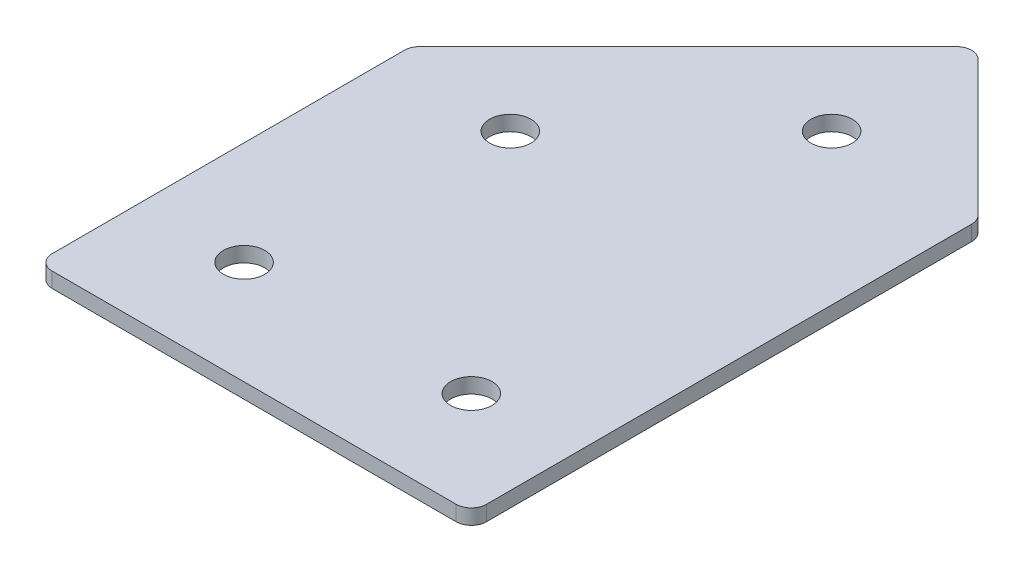
ISO-10303-21;
HEADER;
FILE_DESCRIPTION(('STEP AP214'),'2;1');
FILE_NAME('part.step','',(''),(''),'','','');
FILE_SCHEMA(('AUTOMOTIVE_DESIGN { 1 0 10303 214 1 1 1 1 }'));
ENDSEC;
DATA;
#1=APPLICATION_CONTEXT('core data for automotive mechanical design processes');
#2=APPLICATION_PROTOCOL_DEFINITION('international standard','automotive_design',2000,#1);
#3=PRODUCT_CONTEXT('',#1,'mechanical');
#4=PRODUCT('Part','Part','',(#3));
#5=PRODUCT_RELATED_PRODUCT_CATEGORY('part','',(#4));
#6=PRODUCT_DEFINITION_FORMATION('','',#4);
#7=PRODUCT_DEFINITION_CONTEXT('part definition',#1,'design');
#8=PRODUCT_DEFINITION('design','',#6,#7);
#9=PRODUCT_DEFINITION_SHAPE('','',#8);
#10=(LENGTH_UNIT() NAMED_UNIT(*) SI_UNIT(.MILLI.,.METRE.));
#11=(NAMED_UNIT(*) PLANE_ANGLE_UNIT() SI_UNIT($,.RADIAN.));
#12=(NAMED_UNIT(*) SI_UNIT($,.STERADIAN.) SOLID_ANGLE_UNIT());
#13=UNCERTAINTY_MEASURE_WITH_UNIT(LENGTH_MEASURE(1.E-05),#10,'distance_accuracy_value','');
#14=(GEOMETRIC_REPRESENTATION_CONTEXT(3) GLOBAL_UNCERTAINTY_ASSIGNED_CONTEXT((#13)) GLOBAL_UNIT_ASSIGNED_CONTEXT((#10,
#11,#12)) REPRESENTATION_CONTEXT('',''));
#15=CARTESIAN_POINT('',(0.,0.,0.));
#16=DIRECTION('',(0.,0.,1.));
#17=DIRECTION('',(1.,0.,0.));
#18=AXIS2_PLACEMENT_3D('',#15,#16,#17);
#19=CARTESIAN_POINT('',(-69.8702315611487,2.29118221127328,42.5441315674249));
#20=DIRECTION('',(0.,1.,0.));
#21=DIRECTION('',(0.,0.,1.));
#22=AXIS2_PLACEMENT_3D('',#19,#20,#21);
#23=PLANE('',#22);
#24=CARTESIAN_POINT('',(20.1297684388556,2.29118221127328,42.5441315674249));
#25=DIRECTION('',(0.,1.,0.));
#26=DIRECTION('',(0.,0.,1.));
#27=AXIS2_PLACEMENT_3D('',#24,#25,#26);
#28=CIRCLE('',#27,4.09999999999999);
#29=CARTESIAN_POINT('',(20.1297684388556,2.29118221127328,46.6441315674249));
#30=VERTEX_POINT('',#29);
#31=EDGE_CURVE('E201',#30,#30,#28,.T.);
#32=ORIENTED_EDGE('',*,*,#31,.T.);
#33=EDGE_LOOP('',(#32));
#34=FACE_BOUND('',#33,.T.);
#35=CARTESIAN_POINT('',(10.8099632854608,2.29118221127328,-38.1360632791804));
#36=DIRECTION('',(0.,1.,0.));
#37=DIRECTION('',(0.,0.,1.));
#38=AXIS2_PLACEMENT_3D('',#35,#36,#37);
#39=CIRCLE('',#38,4.09999999999998);
#40=CARTESIAN_POINT('',(10.8099632854608,2.29118221127328,-34.0360632791805));
#41=VERTEX_POINT('',#40);
#42=EDGE_CURVE('E195',#41,#41,#39,.T.);
#43=ORIENTED_EDGE('',*,*,#42,.T.);
#44=EDGE_LOOP('',(#43));
#45=FACE_BOUND('',#44,.T.);
#46=CARTESIAN_POINT('',(-21.0098418679339,2.29118221127328,-6.31625812578581));
#47=DIRECTION('',(0.,1.,0.));
#48=DIRECTION('',(0.,0.,1.));
#49=AXIS2_PLACEMENT_3D('',#46,#47,#48);
#50=CIRCLE('',#49,4.1);
#51=CARTESIAN_POINT('',(-21.0098418679339,2.29118221127328,-2.21625812578581));
#52=VERTEX_POINT('',#51);
#53=EDGE_CURVE('E189',#52,#52,#50,.T.);
#54=ORIENTED_EDGE('',*,*,#53,.T.);
#55=EDGE_LOOP('',(#54));
#56=FACE_BOUND('',#55,.T.);
#57=CARTESIAN_POINT('',(-24.8702315611445,2.29118221127328,42.5441315674249));
#58=DIRECTION('',(0.,1.,0.));
#59=DIRECTION('',(0.,0.,1.));
#60=AXIS2_PLACEMENT_3D('',#57,#58,#59);
#61=CIRCLE('',#60,4.1);
#62=CARTESIAN_POINT('',(-24.8702315611445,2.29118221127328,46.6441315674249));
#63=VERTEX_POINT('',#62);
#64=EDGE_CURVE('E115',#63,#63,#61,.T.);
#65=ORIENTED_EDGE('',*,*,#64,.T.);
#66=EDGE_LOOP('',(#65));
#67=FACE_BOUND('',#66,.T.);
#68=DIRECTION('',(0.,0.,1.));
#69=VECTOR('',#68,1.);
#70=CARTESIAN_POINT('',(-45.3702315611445,2.29118221127328,-10.9472464612239));
#71=LINE('',#70,#69);
#72=CARTESIAN_POINT('',(-45.3702315611445,2.29118221127328,-9.70460577410461));
#73=VERTEX_POINT('',#72);
#74=CARTESIAN_POINT('',(-45.3702315611445,2.29118221127328,60.044131567425));
#75=VERTEX_POINT('',#74);
#76=EDGE_CURVE('E182',#73,#75,#71,.T.);
#77=ORIENTED_EDGE('',*,*,#76,.F.);
#78=CARTESIAN_POINT('',(-42.3702315611445,2.29118221127328,-9.70460577410461));
#79=DIRECTION('',(0.,1.,0.));
#80=DIRECTION('',(0.,0.,1.));
#81=AXIS2_PLACEMENT_3D('',#78,#79,#80);
#82=CIRCLE('',#81,3.);
#83=CARTESIAN_POINT('',(-44.4915519047041,2.29118221127328,-11.8259261176642));
#84=VERTEX_POINT('',#83);
#85=EDGE_CURVE('E146',#73,#84,#82,.F.);
#86=ORIENTED_EDGE('',*,*,#85,.T.);
#87=DIRECTION('',(-0.707106781186547,0.,0.707106781186548));
#88=VECTOR('',#87,1.);
#89=CARTESIAN_POINT('',(10.8099632854607,2.29118221127328,-67.1274413078291));
#90=LINE('',#89,#88);
#91=CARTESIAN_POINT('',(8.68864294190101,2.29118221127328,-65.0061209642694));
#92=VERTEX_POINT('',#91);
#93=EDGE_CURVE('E174',#92,#84,#90,.T.);
#94=ORIENTED_EDGE('',*,*,#93,.F.);
#95=CARTESIAN_POINT('',(10.8099632854607,2.29118221127328,-62.8848006207098));
#96=DIRECTION('',(0.,1.,0.));
#97=DIRECTION('',(0.,0.,1.));
#98=AXIS2_PLACEMENT_3D('',#95,#96,#97);
#99=CIRCLE('',#98,3.);
#100=CARTESIAN_POINT('',(12.9312836290203,2.29118221127328,-65.0061209642694));
#101=VERTEX_POINT('',#100);
#102=EDGE_CURVE('E118',#92,#101,#99,.F.);
#103=ORIENTED_EDGE('',*,*,#102,.T.);
#104=DIRECTION('',(-0.707106781186547,0.,-0.707106781186548));
#105=VECTOR('',#104,1.);
#106=CARTESIAN_POINT('',(40.6297684388556,2.29118221127328,-37.3076361544342));
#107=LINE('',#106,#105);
#108=CARTESIAN_POINT('',(39.7510887824152,2.29118221127328,-38.1863158108745));
#109=VERTEX_POINT('',#108);
#110=EDGE_CURVE('E119',#109,#101,#107,.T.);
#111=ORIENTED_EDGE('',*,*,#110,.F.);
#112=CARTESIAN_POINT('',(37.6297684388556,2.29118221127328,-36.0649954673149));
#113=DIRECTION('',(0.,1.,0.));
#114=DIRECTION('',(0.,0.,1.));
#115=AXIS2_PLACEMENT_3D('',#112,#113,#114);
#116=CIRCLE('',#115,3.);
#117=CARTESIAN_POINT('',(40.6297684388556,2.29118221127328,-36.0649954673149));
#118=VERTEX_POINT('',#117);
#119=EDGE_CURVE('E141',#109,#118,#116,.F.);
#120=ORIENTED_EDGE('',*,*,#119,.T.);
#121=DIRECTION('',(0.,0.,-1.));
#122=VECTOR('',#121,1.);
#123=CARTESIAN_POINT('',(40.6297684388555,2.29118221127328,63.0441315674251));
#124=LINE('',#123,#122);
#125=CARTESIAN_POINT('',(40.6297684388555,2.29118221127328,60.0441315674251));
#126=VERTEX_POINT('',#125);
#127=EDGE_CURVE('E123',#126,#118,#124,.T.);
#128=ORIENTED_EDGE('',*,*,#127,.F.);
#129=CARTESIAN_POINT('',(37.6297684388555,2.29118221127328,60.0441315674251));
#130=DIRECTION('',(0.,1.,0.));
#131=DIRECTION('',(0.,0.,1.));
#132=AXIS2_PLACEMENT_3D('',#129,#130,#131);
#133=CIRCLE('',#132,3.);
#134=CARTESIAN_POINT('',(37.6297684388555,2.29118221127328,63.0441315674251));
#135=VERTEX_POINT('',#134);
#136=EDGE_CURVE('E31',#126,#135,#133,.F.);
#137=ORIENTED_EDGE('',*,*,#136,.T.);
#138=DIRECTION('',(1.,0.,0.));
#139=VECTOR('',#138,1.);
#140=CARTESIAN_POINT('',(-45.3702315611445,2.29118221127328,63.0441315674251));
#141=LINE('',#140,#139);
#142=CARTESIAN_POINT('',(-42.3702315611444,2.29118221127328,63.0441315674251));
#143=VERTEX_POINT('',#142);
#144=EDGE_CURVE('E180',#143,#135,#141,.T.);
#145=ORIENTED_EDGE('',*,*,#144,.F.);
#146=CARTESIAN_POINT('',(-42.3702315611444,2.29118221127328,60.0441315674251));
#147=DIRECTION('',(0.,1.,0.));
#148=DIRECTION('',(0.,0.,1.));
#149=AXIS2_PLACEMENT_3D('',#146,#147,#148);
#150=CIRCLE('',#149,3.);
#151=EDGE_CURVE('E144',#143,#75,#150,.F.);
#152=ORIENTED_EDGE('',*,*,#151,.T.);
#153=EDGE_LOOP('',(#77,#86,#94,#103,#111,#120,#128,#137,#145,#152));
#154=FACE_BOUND('',#153,.T.);
#155=ADVANCED_FACE('F16',(#34,#45,#56,#67,#154),#23,.F.);
#156=CARTESIAN_POINT('',(10.8099632854607,2.29118221127328,-67.1274413078291));
#157=DIRECTION('',(-0.707106781186548,0.,-0.707106781186547));
#158=DIRECTION('',(-0.707106781186547,0.,0.707106781186548));
#159=AXIS2_PLACEMENT_3D('',#156,#157,#158);
#160=PLANE('',#159);
#161=ORIENTED_EDGE('',*,*,#93,.T.);
#162=DIRECTION('',(0.,1.,0.));
#163=VECTOR('',#162,1.);
#164=CARTESIAN_POINT('',(-44.4915519047041,2.29118221127328,-11.8259261176643));
#165=LINE('',#164,#163);
#166=CARTESIAN_POINT('',(-44.4915519047041,5.29118221127328,-11.8259261176642));
#167=VERTEX_POINT('',#166);
#168=EDGE_CURVE('E105',#84,#167,#165,.T.);
#169=ORIENTED_EDGE('',*,*,#168,.T.);
#170=DIRECTION('',(-0.707106781186547,0.,0.707106781186548));
#171=VECTOR('',#170,1.);
#172=CARTESIAN_POINT('',(10.8099632854607,5.29118221127328,-67.1274413078291));
#173=LINE('',#172,#171);
#174=CARTESIAN_POINT('',(8.68864294190101,5.29118221127328,-65.0061209642694));
#175=VERTEX_POINT('',#174);
#176=EDGE_CURVE('E97',#175,#167,#173,.T.);
#177=ORIENTED_EDGE('',*,*,#176,.F.);
#178=DIRECTION('',(0.,1.,0.));
#179=VECTOR('',#178,1.);
#180=CARTESIAN_POINT('',(8.68864294190101,2.29118221127328,-65.0061209642694));
#181=LINE('',#180,#179);
#182=EDGE_CURVE('E111',#175,#92,#181,.F.);
#183=ORIENTED_EDGE('',*,*,#182,.T.);
#184=EDGE_LOOP('',(#161,#169,#177,#183));
#185=FACE_BOUND('',#184,.T.);
#186=ADVANCED_FACE('F110',(#185),#160,.T.);
#187=CARTESIAN_POINT('',(40.6297684388556,2.29118221127328,-37.3076361544342));
#188=DIRECTION('',(0.707106781186548,0.,-0.707106781186547));
#189=DIRECTION('',(-0.707106781186547,0.,-0.707106781186548));
#190=AXIS2_PLACEMENT_3D('',#187,#188,#189);
#191=PLANE('',#190);
#192=DIRECTION('',(-0.707106781186547,0.,-0.707106781186548));
#193=VECTOR('',#192,1.);
#194=CARTESIAN_POINT('',(40.6297684388556,5.29118221127328,-37.3076361544342));
#195=LINE('',#194,#193);
#196=CARTESIAN_POINT('',(39.7510887824152,5.29118221127328,-38.1863158108745));
#197=VERTEX_POINT('',#196);
#198=CARTESIAN_POINT('',(12.9312836290203,5.29118221127328,-65.0061209642694));
#199=VERTEX_POINT('',#198);
#200=EDGE_CURVE('E99',#197,#199,#195,.T.);
#201=ORIENTED_EDGE('',*,*,#200,.F.);
#202=DIRECTION('',(0.,1.,0.));
#203=VECTOR('',#202,1.);
#204=CARTESIAN_POINT('',(39.7510887824152,2.29118221127328,-38.1863158108745));
#205=LINE('',#204,#203);
#206=EDGE_CURVE('E10',#197,#109,#205,.F.);
#207=ORIENTED_EDGE('',*,*,#206,.T.);
#208=ORIENTED_EDGE('',*,*,#110,.T.);
#209=DIRECTION('',(0.,1.,0.));
#210=VECTOR('',#209,1.);
#211=CARTESIAN_POINT('',(12.9312836290203,2.29118221127328,-65.0061209642694));
#212=LINE('',#211,#210);
#213=EDGE_CURVE('E24',#101,#199,#212,.T.);
#214=ORIENTED_EDGE('',*,*,#213,.T.);
#215=EDGE_LOOP('',(#201,#207,#208,#214));
#216=FACE_BOUND('',#215,.T.);
#217=ADVANCED_FACE('F157',(#216),#191,.T.);
#218=CARTESIAN_POINT('',(40.6297684388555,2.29118221127328,63.0441315674251));
#219=DIRECTION('',(1.,0.,0.));
#220=DIRECTION('',(0.,0.,-1.));
#221=AXIS2_PLACEMENT_3D('',#218,#219,#220);
#222=PLANE('',#221);
#223=DIRECTION('',(0.,0.,-1.));
#224=VECTOR('',#223,1.);
#225=CARTESIAN_POINT('',(40.6297684388555,5.29118221127328,63.0441315674251));
#226=LINE('',#225,#224);
#227=CARTESIAN_POINT('',(40.6297684388555,5.29118221127328,60.0441315674251));
#228=VERTEX_POINT('',#227);
#229=CARTESIAN_POINT('',(40.6297684388556,5.29118221127328,-36.0649954673149));
#230=VERTEX_POINT('',#229);
#231=EDGE_CURVE('E170',#228,#230,#226,.T.);
#232=ORIENTED_EDGE('',*,*,#231,.F.);
#233=DIRECTION('',(0.,1.,0.));
#234=VECTOR('',#233,1.);
#235=CARTESIAN_POINT('',(40.6297684388555,2.29118221127328,60.0441315674251));
#236=LINE('',#235,#234);
#237=EDGE_CURVE('E155',#228,#126,#236,.F.);
#238=ORIENTED_EDGE('',*,*,#237,.T.);
#239=ORIENTED_EDGE('',*,*,#127,.T.);
#240=DIRECTION('',(0.,1.,0.));
#241=VECTOR('',#240,1.);
#242=CARTESIAN_POINT('',(40.6297684388556,2.29118221127328,-36.0649954673149));
#243=LINE('',#242,#241);
#244=EDGE_CURVE('E152',#118,#230,#243,.T.);
#245=ORIENTED_EDGE('',*,*,#244,.T.);
#246=EDGE_LOOP('',(#232,#238,#239,#245));
#247=FACE_BOUND('',#246,.T.);
#248=ADVANCED_FACE('F169',(#247),#222,.T.);
#249=CARTESIAN_POINT('',(-45.3702315611445,2.29118221127328,63.0441315674251));
#250=DIRECTION('',(0.,0.,1.));
#251=DIRECTION('',(1.,0.,0.));
#252=AXIS2_PLACEMENT_3D('',#249,#250,#251);
#253=PLANE('',#252);
#254=DIRECTION('',(1.,0.,0.));
#255=VECTOR('',#254,1.);
#256=CARTESIAN_POINT('',(-45.3702315611445,5.29118221127328,63.0441315674251));
#257=LINE('',#256,#255);
#258=CARTESIAN_POINT('',(-42.3702315611444,5.29118221127328,63.0441315674251));
#259=VERTEX_POINT('',#258);
#260=CARTESIAN_POINT('',(37.6297684388555,5.29118221127328,63.0441315674251));
#261=VERTEX_POINT('',#260);
#262=EDGE_CURVE('E173',#259,#261,#257,.T.);
#263=ORIENTED_EDGE('',*,*,#262,.F.);
#264=DIRECTION('',(0.,1.,0.));
#265=VECTOR('',#264,1.);
#266=CARTESIAN_POINT('',(-42.3702315611444,2.29118221127328,63.0441315674251));
#267=LINE('',#266,#265);
#268=EDGE_CURVE('E38',#259,#143,#267,.F.);
#269=ORIENTED_EDGE('',*,*,#268,.T.);
#270=ORIENTED_EDGE('',*,*,#144,.T.);
#271=DIRECTION('',(0.,1.,0.));
#272=VECTOR('',#271,1.);
#273=CARTESIAN_POINT('',(37.6297684388555,2.29118221127328,63.0441315674251));
#274=LINE('',#273,#272);
#275=EDGE_CURVE('E148',#135,#261,#274,.T.);
#276=ORIENTED_EDGE('',*,*,#275,.T.);
#277=EDGE_LOOP('',(#263,#269,#270,#276));
#278=FACE_BOUND('',#277,.T.);
#279=ADVANCED_FACE('F333',(#278),#253,.T.);
#280=CARTESIAN_POINT('',(-45.3702315611445,2.29118221127328,-10.9472464612239));
#281=DIRECTION('',(-1.,0.,0.));
#282=DIRECTION('',(0.,0.,1.));
#283=AXIS2_PLACEMENT_3D('',#280,#281,#282);
#284=PLANE('',#283);
#285=DIRECTION('',(0.,0.,1.));
#286=VECTOR('',#285,1.);
#287=CARTESIAN_POINT('',(-45.3702315611445,5.29118221127328,-10.9472464612239));
#288=LINE('',#287,#286);
#289=CARTESIAN_POINT('',(-45.3702315611445,5.29118221127328,-9.70460577410461));
#290=VERTEX_POINT('',#289);
#291=CARTESIAN_POINT('',(-45.3702315611445,5.29118221127328,60.044131567425));
#292=VERTEX_POINT('',#291);
#293=EDGE_CURVE('E114',#290,#292,#288,.T.);
#294=ORIENTED_EDGE('',*,*,#293,.F.);
#295=DIRECTION('',(0.,1.,0.));
#296=VECTOR('',#295,1.);
#297=CARTESIAN_POINT('',(-45.3702315611445,2.29118221127328,-9.70460577410461));
#298=LINE('',#297,#296);
#299=EDGE_CURVE('E138',#290,#73,#298,.F.);
#300=ORIENTED_EDGE('',*,*,#299,.T.);
#301=ORIENTED_EDGE('',*,*,#76,.T.);
#302=DIRECTION('',(0.,1.,0.));
#303=VECTOR('',#302,1.);
#304=CARTESIAN_POINT('',(-45.3702315611445,2.29118221127328,60.0441315674251));
#305=LINE('',#304,#303);
#306=EDGE_CURVE('E135',#75,#292,#305,.T.);
#307=ORIENTED_EDGE('',*,*,#306,.T.);
#308=EDGE_LOOP('',(#294,#300,#301,#307));
#309=FACE_BOUND('',#308,.T.);
#310=ADVANCED_FACE('F223',(#309),#284,.T.);
#311=CARTESIAN_POINT('',(-69.8702315611487,5.29118221127328,42.5441315674249));
#312=DIRECTION('',(0.,1.,0.));
#313=DIRECTION('',(0.,0.,1.));
#314=AXIS2_PLACEMENT_3D('',#311,#312,#313);
#315=PLANE('',#314);
#316=CARTESIAN_POINT('',(20.1297684388556,5.29118221127328,42.5441315674249));
#317=DIRECTION('',(0.,1.,0.));
#318=DIRECTION('',(0.,0.,1.));
#319=AXIS2_PLACEMENT_3D('',#316,#317,#318);
#320=CIRCLE('',#319,4.09999999999999);
#321=CARTESIAN_POINT('',(20.1297684388556,5.29118221127328,46.6441315674249));
#322=VERTEX_POINT('',#321);
#323=EDGE_CURVE('E204',#322,#322,#320,.T.);
#324=ORIENTED_EDGE('',*,*,#323,.F.);
#325=EDGE_LOOP('',(#324));
#326=FACE_BOUND('',#325,.T.);
#327=CARTESIAN_POINT('',(10.8099632854608,5.29118221127328,-38.1360632791804));
#328=DIRECTION('',(0.,1.,0.));
#329=DIRECTION('',(0.,0.,1.));
#330=AXIS2_PLACEMENT_3D('',#327,#328,#329);
#331=CIRCLE('',#330,4.09999999999998);
#332=CARTESIAN_POINT('',(10.8099632854608,5.29118221127328,-34.0360632791805));
#333=VERTEX_POINT('',#332);
#334=EDGE_CURVE('E198',#333,#333,#331,.T.);
#335=ORIENTED_EDGE('',*,*,#334,.F.);
#336=EDGE_LOOP('',(#335));
#337=FACE_BOUND('',#336,.T.);
#338=CARTESIAN_POINT('',(-21.0098418679339,5.29118221127328,-6.31625812578581));
#339=DIRECTION('',(0.,1.,0.));
#340=DIRECTION('',(0.,0.,1.));
#341=AXIS2_PLACEMENT_3D('',#338,#339,#340);
#342=CIRCLE('',#341,4.1);
#343=CARTESIAN_POINT('',(-21.0098418679339,5.29118221127328,-2.21625812578581));
#344=VERTEX_POINT('',#343);
#345=EDGE_CURVE('E192',#344,#344,#342,.T.);
#346=ORIENTED_EDGE('',*,*,#345,.F.);
#347=EDGE_LOOP('',(#346));
#348=FACE_BOUND('',#347,.T.);
#349=CARTESIAN_POINT('',(-24.8702315611445,5.29118221127328,42.5441315674249));
#350=DIRECTION('',(0.,1.,0.));
#351=DIRECTION('',(0.,0.,1.));
#352=AXIS2_PLACEMENT_3D('',#349,#350,#351);
#353=CIRCLE('',#352,4.1);
#354=CARTESIAN_POINT('',(-24.8702315611445,5.29118221127328,46.6441315674249));
#355=VERTEX_POINT('',#354);
#356=EDGE_CURVE('E186',#355,#355,#353,.T.);
#357=ORIENTED_EDGE('',*,*,#356,.F.);
#358=EDGE_LOOP('',(#357));
#359=FACE_BOUND('',#358,.T.);
#360=ORIENTED_EDGE('',*,*,#176,.T.);
#361=CARTESIAN_POINT('',(-42.3702315611445,5.29118221127328,-9.70460577410461));
#362=DIRECTION('',(0.,1.,0.));
#363=DIRECTION('',(0.,0.,1.));
#364=AXIS2_PLACEMENT_3D('',#361,#362,#363);
#365=CIRCLE('',#364,3.);
#366=EDGE_CURVE('E133',#167,#290,#365,.T.);
#367=ORIENTED_EDGE('',*,*,#366,.T.);
#368=ORIENTED_EDGE('',*,*,#293,.T.);
#369=CARTESIAN_POINT('',(-42.3702315611444,5.29118221127328,60.0441315674251));
#370=DIRECTION('',(0.,1.,0.));
#371=DIRECTION('',(0.,0.,1.));
#372=AXIS2_PLACEMENT_3D('',#369,#370,#371);
#373=CIRCLE('',#372,3.);
#374=EDGE_CURVE('E131',#292,#259,#373,.T.);
#375=ORIENTED_EDGE('',*,*,#374,.T.);
#376=ORIENTED_EDGE('',*,*,#262,.T.);
#377=CARTESIAN_POINT('',(37.6297684388555,5.29118221127328,60.0441315674251));
#378=DIRECTION('',(0.,1.,0.));
#379=DIRECTION('',(0.,0.,1.));
#380=AXIS2_PLACEMENT_3D('',#377,#378,#379);
#381=CIRCLE('',#380,3.);
#382=EDGE_CURVE('E129',#261,#228,#381,.T.);
#383=ORIENTED_EDGE('',*,*,#382,.T.);
#384=ORIENTED_EDGE('',*,*,#231,.T.);
#385=CARTESIAN_POINT('',(37.6297684388556,5.29118221127328,-36.0649954673149));
#386=DIRECTION('',(0.,1.,0.));
#387=DIRECTION('',(0.,0.,1.));
#388=AXIS2_PLACEMENT_3D('',#385,#386,#387);
#389=CIRCLE('',#388,3.);
#390=EDGE_CURVE('E104',#230,#197,#389,.T.);
#391=ORIENTED_EDGE('',*,*,#390,.T.);
#392=ORIENTED_EDGE('',*,*,#200,.T.);
#393=CARTESIAN_POINT('',(10.8099632854607,5.29118221127328,-62.8848006207098));
#394=DIRECTION('',(0.,1.,0.));
#395=DIRECTION('',(0.,0.,1.));
#396=AXIS2_PLACEMENT_3D('',#393,#394,#395);
#397=CIRCLE('',#396,3.);
#398=EDGE_CURVE('E94',#199,#175,#397,.T.);
#399=ORIENTED_EDGE('',*,*,#398,.T.);
#400=EDGE_LOOP('',(#360,#367,#368,#375,#376,#383,#384,#391,#392,#399));
#401=FACE_BOUND('',#400,.T.);
#402=ADVANCED_FACE('F96',(#326,#337,#348,#359,#401),#315,.T.);
#403=CARTESIAN_POINT('',(-24.8702315611445,2.29118221127328,42.5441315674249));
#404=DIRECTION('',(0.,1.,0.));
#405=DIRECTION('',(0.,0.,1.));
#406=AXIS2_PLACEMENT_3D('',#403,#404,#405);
#407=CYLINDRICAL_SURFACE('',#406,4.1);
#408=ORIENTED_EDGE('',*,*,#64,.F.);
#409=EDGE_LOOP('',(#408));
#410=FACE_BOUND('',#409,.T.);
#411=ORIENTED_EDGE('',*,*,#356,.T.);
#412=EDGE_LOOP('',(#411));
#413=FACE_BOUND('',#412,.T.);
#414=ADVANCED_FACE('F222',(#410,#413),#407,.F.);
#415=CARTESIAN_POINT('',(-21.0098418679339,2.29118221127328,-6.31625812578581));
#416=DIRECTION('',(0.,1.,0.));
#417=DIRECTION('',(0.,0.,1.));
#418=AXIS2_PLACEMENT_3D('',#415,#416,#417);
#419=CYLINDRICAL_SURFACE('',#418,4.1);
#420=ORIENTED_EDGE('',*,*,#53,.F.);
#421=EDGE_LOOP('',(#420));
#422=FACE_BOUND('',#421,.T.);
#423=ORIENTED_EDGE('',*,*,#345,.T.);
#424=EDGE_LOOP('',(#423));
#425=FACE_BOUND('',#424,.T.);
#426=ADVANCED_FACE('F232',(#422,#425),#419,.F.);
#427=CARTESIAN_POINT('',(10.8099632854608,2.29118221127328,-38.1360632791804));
#428=DIRECTION('',(0.,1.,0.));
#429=DIRECTION('',(0.,0.,1.));
#430=AXIS2_PLACEMENT_3D('',#427,#428,#429);
#431=CYLINDRICAL_SURFACE('',#430,4.09999999999998);
#432=ORIENTED_EDGE('',*,*,#42,.F.);
#433=EDGE_LOOP('',(#432));
#434=FACE_BOUND('',#433,.T.);
#435=ORIENTED_EDGE('',*,*,#334,.T.);
#436=EDGE_LOOP('',(#435));
#437=FACE_BOUND('',#436,.T.);
#438=ADVANCED_FACE('F216',(#434,#437),#431,.F.);
#439=CARTESIAN_POINT('',(20.1297684388556,2.29118221127328,42.5441315674249));
#440=DIRECTION('',(0.,1.,0.));
#441=DIRECTION('',(0.,0.,1.));
#442=AXIS2_PLACEMENT_3D('',#439,#440,#441);
#443=CYLINDRICAL_SURFACE('',#442,4.09999999999999);
#444=ORIENTED_EDGE('',*,*,#31,.F.);
#445=EDGE_LOOP('',(#444));
#446=FACE_BOUND('',#445,.T.);
#447=ORIENTED_EDGE('',*,*,#323,.T.);
#448=EDGE_LOOP('',(#447));
#449=FACE_BOUND('',#448,.T.);
#450=ADVANCED_FACE('F212',(#446,#449),#443,.F.);
#451=CARTESIAN_POINT('',(-42.3702315611445,2.29118221127328,-9.70460577410461));
#452=DIRECTION('',(0.,1.,0.));
#453=DIRECTION('',(0.,0.,1.));
#454=AXIS2_PLACEMENT_3D('',#451,#452,#453);
#455=CYLINDRICAL_SURFACE('',#454,3.);
#456=ORIENTED_EDGE('',*,*,#85,.F.);
#457=ORIENTED_EDGE('',*,*,#299,.F.);
#458=ORIENTED_EDGE('',*,*,#366,.F.);
#459=ORIENTED_EDGE('',*,*,#168,.F.);
#460=EDGE_LOOP('',(#456,#457,#458,#459));
#461=FACE_BOUND('',#460,.T.);
#462=ADVANCED_FACE('F215',(#461),#455,.T.);
#463=CARTESIAN_POINT('',(-42.3702315611444,2.29118221127328,60.0441315674251));
#464=DIRECTION('',(0.,1.,0.));
#465=DIRECTION('',(0.,0.,1.));
#466=AXIS2_PLACEMENT_3D('',#463,#464,#465);
#467=CYLINDRICAL_SURFACE('',#466,3.);
#468=ORIENTED_EDGE('',*,*,#151,.F.);
#469=ORIENTED_EDGE('',*,*,#268,.F.);
#470=ORIENTED_EDGE('',*,*,#374,.F.);
#471=ORIENTED_EDGE('',*,*,#306,.F.);
#472=EDGE_LOOP('',(#468,#469,#470,#471));
#473=FACE_BOUND('',#472,.T.);
#474=ADVANCED_FACE('F252',(#473),#467,.T.);
#475=CARTESIAN_POINT('',(37.6297684388555,2.29118221127328,60.0441315674251));
#476=DIRECTION('',(0.,1.,0.));
#477=DIRECTION('',(0.,0.,1.));
#478=AXIS2_PLACEMENT_3D('',#475,#476,#477);
#479=CYLINDRICAL_SURFACE('',#478,3.);
#480=ORIENTED_EDGE('',*,*,#136,.F.);
#481=ORIENTED_EDGE('',*,*,#237,.F.);
#482=ORIENTED_EDGE('',*,*,#382,.F.);
#483=ORIENTED_EDGE('',*,*,#275,.F.);
#484=EDGE_LOOP('',(#480,#481,#482,#483));
#485=FACE_BOUND('',#484,.T.);
#486=ADVANCED_FACE('F256',(#485),#479,.T.);
#487=CARTESIAN_POINT('',(37.6297684388556,2.29118221127328,-36.0649954673149));
#488=DIRECTION('',(0.,1.,0.));
#489=DIRECTION('',(0.,0.,1.));
#490=AXIS2_PLACEMENT_3D('',#487,#488,#489);
#491=CYLINDRICAL_SURFACE('',#490,3.);
#492=ORIENTED_EDGE('',*,*,#119,.F.);
#493=ORIENTED_EDGE('',*,*,#206,.F.);
#494=ORIENTED_EDGE('',*,*,#390,.F.);
#495=ORIENTED_EDGE('',*,*,#244,.F.);
#496=EDGE_LOOP('',(#492,#493,#494,#495));
#497=FACE_BOUND('',#496,.T.);
#498=ADVANCED_FACE('F165',(#497),#491,.T.);
#499=CARTESIAN_POINT('',(10.8099632854607,2.29118221127328,-62.8848006207098));
#500=DIRECTION('',(0.,1.,0.));
#501=DIRECTION('',(0.,0.,1.));
#502=AXIS2_PLACEMENT_3D('',#499,#500,#501);
#503=CYLINDRICAL_SURFACE('',#502,3.);
#504=ORIENTED_EDGE('',*,*,#102,.F.);
#505=ORIENTED_EDGE('',*,*,#182,.F.);
#506=ORIENTED_EDGE('',*,*,#398,.F.);
#507=ORIENTED_EDGE('',*,*,#213,.F.);
#508=EDGE_LOOP('',(#504,#505,#506,#507));
#509=FACE_BOUND('',#508,.T.);
#510=ADVANCED_FACE('F18',(#509),#503,.T.);
#511=CLOSED_SHELL('',(#155,#186,#217,#248,#279,#310,#402,#414,#426,#438,#450,#462,#474,#486,
#498,#510));
#512=MANIFOLD_SOLID_BREP('B1',#511);
#513=ADVANCED_BREP_SHAPE_REPRESENTATION('',(#18,#512),#14);
#514=SHAPE_DEFINITION_REPRESENTATION(#9,#513);
ENDSEC;
END-ISO-10303-21;
